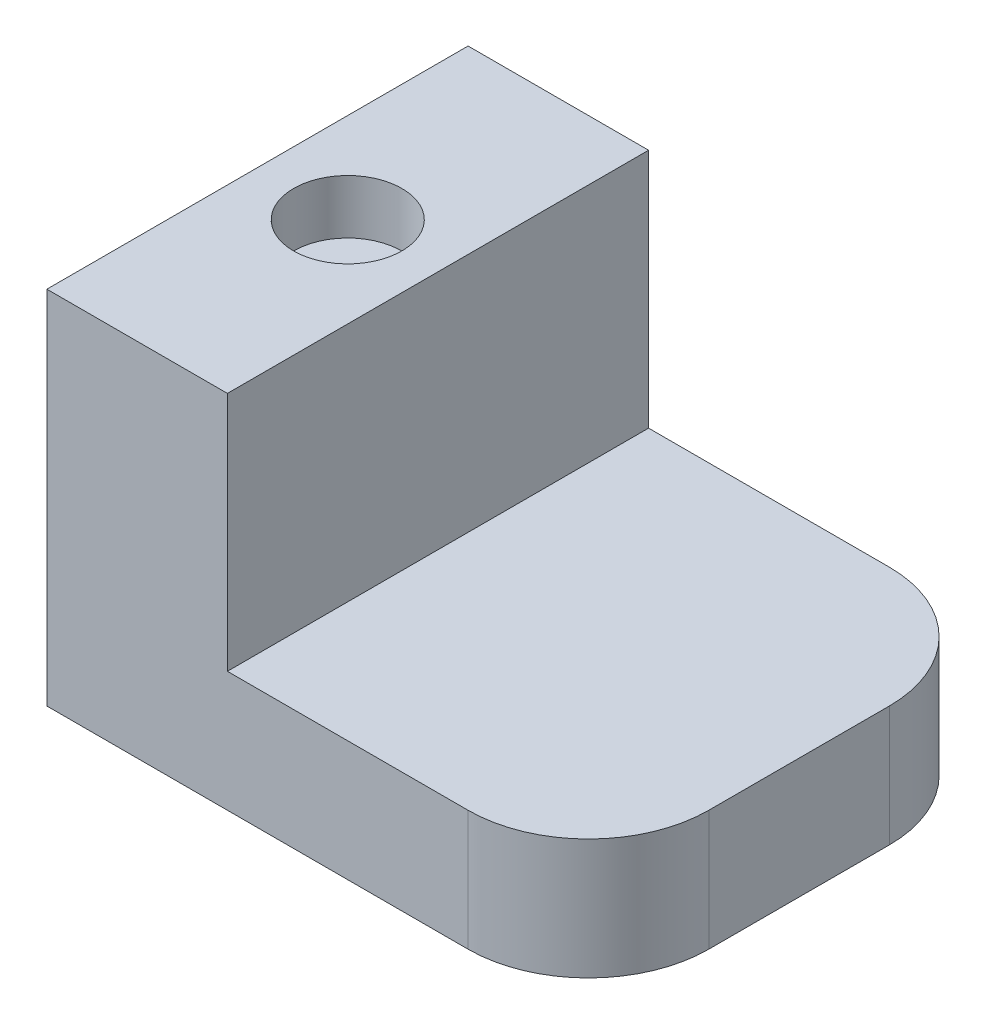
ISO-10303-21;
HEADER;
FILE_DESCRIPTION(('STEP AP214'),'2;1');
FILE_NAME('part.step','',(''),(''),'','','');
FILE_SCHEMA(('AUTOMOTIVE_DESIGN { 1 0 10303 214 1 1 1 1 }'));
ENDSEC;
DATA;
#1=APPLICATION_CONTEXT('core data for automotive mechanical design processes');
#2=APPLICATION_PROTOCOL_DEFINITION('international standard','automotive_design',2000,#1);
#3=PRODUCT_CONTEXT('',#1,'mechanical');
#4=PRODUCT('Part','Part','',(#3));
#5=PRODUCT_RELATED_PRODUCT_CATEGORY('part','',(#4));
#6=PRODUCT_DEFINITION_FORMATION('','',#4);
#7=PRODUCT_DEFINITION_CONTEXT('part definition',#1,'design');
#8=PRODUCT_DEFINITION('design','',#6,#7);
#9=PRODUCT_DEFINITION_SHAPE('','',#8);
#10=(LENGTH_UNIT() NAMED_UNIT(*) SI_UNIT(.MILLI.,.METRE.));
#11=(NAMED_UNIT(*) PLANE_ANGLE_UNIT() SI_UNIT($,.RADIAN.));
#12=(NAMED_UNIT(*) SI_UNIT($,.STERADIAN.) SOLID_ANGLE_UNIT());
#13=UNCERTAINTY_MEASURE_WITH_UNIT(LENGTH_MEASURE(1.E-05),#10,'distance_accuracy_value','');
#14=(GEOMETRIC_REPRESENTATION_CONTEXT(3) GLOBAL_UNCERTAINTY_ASSIGNED_CONTEXT((#13)) GLOBAL_UNIT_ASSIGNED_CONTEXT((#10,
#11,#12)) REPRESENTATION_CONTEXT('',''));
#15=CARTESIAN_POINT('',(0.,0.,0.));
#16=DIRECTION('',(0.,0.,1.));
#17=DIRECTION('',(1.,0.,0.));
#18=AXIS2_PLACEMENT_3D('',#15,#16,#17);
#19=CARTESIAN_POINT('',(0.,0.,70.));
#20=DIRECTION('',(1.,0.,0.));
#21=DIRECTION('',(0.,0.,-1.));
#22=AXIS2_PLACEMENT_3D('',#19,#20,#21);
#23=PLANE('',#22);
#24=DIRECTION('',(0.,-1.,0.));
#25=VECTOR('',#24,1.);
#26=CARTESIAN_POINT('',(0.,0.,0.));
#27=LINE('',#26,#25);
#28=CARTESIAN_POINT('',(0.,60.,0.));
#29=VERTEX_POINT('',#28);
#30=CARTESIAN_POINT('',(0.,0.,0.));
#31=VERTEX_POINT('',#30);
#32=EDGE_CURVE('E121',#29,#31,#27,.T.);
#33=ORIENTED_EDGE('',*,*,#32,.T.);
#34=DIRECTION('',(0.,0.,-1.));
#35=VECTOR('',#34,1.);
#36=CARTESIAN_POINT('',(0.,0.,70.));
#37=LINE('',#36,#35);
#38=CARTESIAN_POINT('',(0.,0.,70.));
#39=VERTEX_POINT('',#38);
#40=EDGE_CURVE('E136',#39,#31,#37,.T.);
#41=ORIENTED_EDGE('',*,*,#40,.F.);
#42=DIRECTION('',(0.,-1.,0.));
#43=VECTOR('',#42,1.);
#44=CARTESIAN_POINT('',(0.,0.,70.));
#45=LINE('',#44,#43);
#46=CARTESIAN_POINT('',(0.,60.,70.));
#47=VERTEX_POINT('',#46);
#48=EDGE_CURVE('E122',#47,#39,#45,.T.);
#49=ORIENTED_EDGE('',*,*,#48,.F.);
#50=DIRECTION('',(0.,0.,-1.));
#51=VECTOR('',#50,1.);
#52=CARTESIAN_POINT('',(0.,60.,70.));
#53=LINE('',#52,#51);
#54=EDGE_CURVE('E131',#47,#29,#53,.T.);
#55=ORIENTED_EDGE('',*,*,#54,.T.);
#56=EDGE_LOOP('',(#33,#41,#49,#55));
#57=FACE_BOUND('',#56,.T.);
#58=ADVANCED_FACE('F32',(#57),#23,.F.);
#59=CARTESIAN_POINT('',(0.,0.,70.));
#60=DIRECTION('',(0.,1.,0.));
#61=DIRECTION('',(0.,0.,1.));
#62=AXIS2_PLACEMENT_3D('',#59,#60,#61);
#63=PLANE('',#62);
#64=DIRECTION('',(1.,0.,0.));
#65=VECTOR('',#64,1.);
#66=CARTESIAN_POINT('',(0.,0.,0.));
#67=LINE('',#66,#65);
#68=CARTESIAN_POINT('',(70.,0.,0.));
#69=VERTEX_POINT('',#68);
#70=EDGE_CURVE('E123',#31,#69,#67,.T.);
#71=ORIENTED_EDGE('',*,*,#70,.T.);
#72=CARTESIAN_POINT('',(70.,0.,20.));
#73=DIRECTION('',(0.,1.,0.));
#74=DIRECTION('',(0.,0.,1.));
#75=AXIS2_PLACEMENT_3D('',#72,#73,#74);
#76=CIRCLE('',#75,20.);
#77=CARTESIAN_POINT('',(90.,0.,20.));
#78=VERTEX_POINT('',#77);
#79=EDGE_CURVE('E40',#69,#78,#76,.F.);
#80=ORIENTED_EDGE('',*,*,#79,.T.);
#81=DIRECTION('',(0.,0.,-1.));
#82=VECTOR('',#81,1.);
#83=CARTESIAN_POINT('',(90.,0.,70.));
#84=LINE('',#83,#82);
#85=CARTESIAN_POINT('',(90.,0.,50.));
#86=VERTEX_POINT('',#85);
#87=EDGE_CURVE('E133',#86,#78,#84,.T.);
#88=ORIENTED_EDGE('',*,*,#87,.F.);
#89=CARTESIAN_POINT('',(70.,0.,50.));
#90=DIRECTION('',(0.,1.,0.));
#91=DIRECTION('',(0.,0.,1.));
#92=AXIS2_PLACEMENT_3D('',#89,#90,#91);
#93=CIRCLE('',#92,20.);
#94=CARTESIAN_POINT('',(70.,0.,70.));
#95=VERTEX_POINT('',#94);
#96=EDGE_CURVE('E47',#86,#95,#93,.F.);
#97=ORIENTED_EDGE('',*,*,#96,.T.);
#98=DIRECTION('',(1.,0.,0.));
#99=VECTOR('',#98,1.);
#100=CARTESIAN_POINT('',(0.,0.,70.));
#101=LINE('',#100,#99);
#102=EDGE_CURVE('E126',#39,#95,#101,.T.);
#103=ORIENTED_EDGE('',*,*,#102,.F.);
#104=ORIENTED_EDGE('',*,*,#40,.T.);
#105=EDGE_LOOP('',(#71,#80,#88,#97,#103,#104));
#106=FACE_BOUND('',#105,.T.);
#107=ADVANCED_FACE('F150',(#106),#63,.F.);
#108=CARTESIAN_POINT('',(90.,0.,70.));
#109=DIRECTION('',(-1.,0.,0.));
#110=DIRECTION('',(0.,0.,1.));
#111=AXIS2_PLACEMENT_3D('',#108,#109,#110);
#112=PLANE('',#111);
#113=ORIENTED_EDGE('',*,*,#87,.T.);
#114=DIRECTION('',(0.,1.,0.));
#115=VECTOR('',#114,1.);
#116=CARTESIAN_POINT('',(90.,20.,20.));
#117=LINE('',#116,#115);
#118=CARTESIAN_POINT('',(90.,20.,20.));
#119=VERTEX_POINT('',#118);
#120=EDGE_CURVE('E141',#78,#119,#117,.T.);
#121=ORIENTED_EDGE('',*,*,#120,.T.);
#122=DIRECTION('',(0.,0.,1.));
#123=VECTOR('',#122,1.);
#124=CARTESIAN_POINT('',(90.,20.,0.));
#125=LINE('',#124,#123);
#126=CARTESIAN_POINT('',(90.,20.,50.));
#127=VERTEX_POINT('',#126);
#128=EDGE_CURVE('E161',#119,#127,#125,.T.);
#129=ORIENTED_EDGE('',*,*,#128,.T.);
#130=DIRECTION('',(0.,1.,0.));
#131=VECTOR('',#130,1.);
#132=CARTESIAN_POINT('',(90.,0.,50.));
#133=LINE('',#132,#131);
#134=EDGE_CURVE('E139',#127,#86,#133,.F.);
#135=ORIENTED_EDGE('',*,*,#134,.T.);
#136=EDGE_LOOP('',(#113,#121,#129,#135));
#137=FACE_BOUND('',#136,.T.);
#138=ADVANCED_FACE('F154',(#137),#112,.F.);
#139=CARTESIAN_POINT('',(0.,60.,70.));
#140=DIRECTION('',(0.,-1.,0.));
#141=DIRECTION('',(0.,0.,-1.));
#142=AXIS2_PLACEMENT_3D('',#139,#140,#141);
#143=PLANE('',#142);
#144=CARTESIAN_POINT('',(15.,60.,35.));
#145=DIRECTION('',(0.,1.,0.));
#146=DIRECTION('',(0.,0.,1.));
#147=AXIS2_PLACEMENT_3D('',#144,#145,#146);
#148=CIRCLE('',#147,9.);
#149=CARTESIAN_POINT('',(15.,60.,44.));
#150=VERTEX_POINT('',#149);
#151=EDGE_CURVE('E216',#150,#150,#148,.T.);
#152=ORIENTED_EDGE('',*,*,#151,.F.);
#153=EDGE_LOOP('',(#152));
#154=FACE_BOUND('',#153,.T.);
#155=DIRECTION('',(-1.,0.,0.));
#156=VECTOR('',#155,1.);
#157=CARTESIAN_POINT('',(0.,60.,70.));
#158=LINE('',#157,#156);
#159=CARTESIAN_POINT('',(30.,60.,70.));
#160=VERTEX_POINT('',#159);
#161=EDGE_CURVE('E116',#160,#47,#158,.T.);
#162=ORIENTED_EDGE('',*,*,#161,.F.);
#163=DIRECTION('',(0.,0.,1.));
#164=VECTOR('',#163,1.);
#165=CARTESIAN_POINT('',(30.,60.,0.));
#166=LINE('',#165,#164);
#167=CARTESIAN_POINT('',(30.,60.,0.));
#168=VERTEX_POINT('',#167);
#169=EDGE_CURVE('E103',#168,#160,#166,.T.);
#170=ORIENTED_EDGE('',*,*,#169,.F.);
#171=DIRECTION('',(-1.,0.,0.));
#172=VECTOR('',#171,1.);
#173=CARTESIAN_POINT('',(0.,60.,0.));
#174=LINE('',#173,#172);
#175=EDGE_CURVE('E114',#168,#29,#174,.T.);
#176=ORIENTED_EDGE('',*,*,#175,.T.);
#177=ORIENTED_EDGE('',*,*,#54,.F.);
#178=EDGE_LOOP('',(#162,#170,#176,#177));
#179=FACE_BOUND('',#178,.T.);
#180=ADVANCED_FACE('F112',(#154,#179),#143,.F.);
#181=CARTESIAN_POINT('',(0.,0.,70.));
#182=DIRECTION('',(0.,0.,-1.));
#183=DIRECTION('',(-1.,0.,0.));
#184=AXIS2_PLACEMENT_3D('',#181,#182,#183);
#185=PLANE('',#184);
#186=ORIENTED_EDGE('',*,*,#102,.T.);
#187=DIRECTION('',(0.,1.,0.));
#188=VECTOR('',#187,1.);
#189=CARTESIAN_POINT('',(70.,0.,70.));
#190=LINE('',#189,#188);
#191=CARTESIAN_POINT('',(70.,20.,70.));
#192=VERTEX_POINT('',#191);
#193=EDGE_CURVE('E11',#95,#192,#190,.T.);
#194=ORIENTED_EDGE('',*,*,#193,.T.);
#195=DIRECTION('',(1.,0.,0.));
#196=VECTOR('',#195,1.);
#197=CARTESIAN_POINT('',(90.,20.,70.));
#198=LINE('',#197,#196);
#199=CARTESIAN_POINT('',(30.,20.,70.));
#200=VERTEX_POINT('',#199);
#201=EDGE_CURVE('E108',#200,#192,#198,.T.);
#202=ORIENTED_EDGE('',*,*,#201,.F.);
#203=DIRECTION('',(0.,-1.,0.));
#204=VECTOR('',#203,1.);
#205=CARTESIAN_POINT('',(30.,60.,70.));
#206=LINE('',#205,#204);
#207=EDGE_CURVE('E165',#160,#200,#206,.T.);
#208=ORIENTED_EDGE('',*,*,#207,.F.);
#209=ORIENTED_EDGE('',*,*,#161,.T.);
#210=ORIENTED_EDGE('',*,*,#48,.T.);
#211=EDGE_LOOP('',(#186,#194,#202,#208,#209,#210));
#212=FACE_BOUND('',#211,.T.);
#213=ADVANCED_FACE('F177',(#212),#185,.F.);
#214=CARTESIAN_POINT('',(0.,0.,0.));
#215=DIRECTION('',(0.,0.,-1.));
#216=DIRECTION('',(-1.,0.,0.));
#217=AXIS2_PLACEMENT_3D('',#214,#215,#216);
#218=PLANE('',#217);
#219=DIRECTION('',(1.,0.,0.));
#220=VECTOR('',#219,1.);
#221=CARTESIAN_POINT('',(90.,20.,0.));
#222=LINE('',#221,#220);
#223=CARTESIAN_POINT('',(30.,20.,0.));
#224=VERTEX_POINT('',#223);
#225=CARTESIAN_POINT('',(70.,20.,0.));
#226=VERTEX_POINT('',#225);
#227=EDGE_CURVE('E107',#224,#226,#222,.T.);
#228=ORIENTED_EDGE('',*,*,#227,.T.);
#229=DIRECTION('',(0.,1.,0.));
#230=VECTOR('',#229,1.);
#231=CARTESIAN_POINT('',(70.,0.,0.));
#232=LINE('',#231,#230);
#233=EDGE_CURVE('E55',#226,#69,#232,.F.);
#234=ORIENTED_EDGE('',*,*,#233,.T.);
#235=ORIENTED_EDGE('',*,*,#70,.F.);
#236=ORIENTED_EDGE('',*,*,#32,.F.);
#237=ORIENTED_EDGE('',*,*,#175,.F.);
#238=DIRECTION('',(0.,-1.,0.));
#239=VECTOR('',#238,1.);
#240=CARTESIAN_POINT('',(30.,60.,0.));
#241=LINE('',#240,#239);
#242=EDGE_CURVE('E99',#168,#224,#241,.T.);
#243=ORIENTED_EDGE('',*,*,#242,.T.);
#244=EDGE_LOOP('',(#228,#234,#235,#236,#237,#243));
#245=FACE_BOUND('',#244,.T.);
#246=ADVANCED_FACE('F119',(#245),#218,.T.);
#247=CARTESIAN_POINT('',(90.,20.,0.));
#248=DIRECTION('',(0.,-1.,0.));
#249=DIRECTION('',(1.,0.,0.));
#250=AXIS2_PLACEMENT_3D('',#247,#248,#249);
#251=PLANE('',#250);
#252=ORIENTED_EDGE('',*,*,#128,.F.);
#253=CARTESIAN_POINT('',(70.,20.,20.));
#254=DIRECTION('',(0.,-1.,0.));
#255=DIRECTION('',(1.,0.,0.));
#256=AXIS2_PLACEMENT_3D('',#253,#254,#255);
#257=CIRCLE('',#256,20.);
#258=EDGE_CURVE('E146',#119,#226,#257,.F.);
#259=ORIENTED_EDGE('',*,*,#258,.T.);
#260=ORIENTED_EDGE('',*,*,#227,.F.);
#261=DIRECTION('',(0.,0.,1.));
#262=VECTOR('',#261,1.);
#263=CARTESIAN_POINT('',(30.,20.,0.));
#264=LINE('',#263,#262);
#265=EDGE_CURVE('E105',#224,#200,#264,.T.);
#266=ORIENTED_EDGE('',*,*,#265,.T.);
#267=ORIENTED_EDGE('',*,*,#201,.T.);
#268=CARTESIAN_POINT('',(70.,20.,50.));
#269=DIRECTION('',(0.,-1.,0.));
#270=DIRECTION('',(1.,0.,0.));
#271=AXIS2_PLACEMENT_3D('',#268,#269,#270);
#272=CIRCLE('',#271,20.);
#273=EDGE_CURVE('E144',#192,#127,#272,.F.);
#274=ORIENTED_EDGE('',*,*,#273,.T.);
#275=EDGE_LOOP('',(#252,#259,#260,#266,#267,#274));
#276=FACE_BOUND('',#275,.T.);
#277=ADVANCED_FACE('F160',(#276),#251,.F.);
#278=CARTESIAN_POINT('',(30.,60.,0.));
#279=DIRECTION('',(-1.,0.,0.));
#280=DIRECTION('',(0.,-1.,0.));
#281=AXIS2_PLACEMENT_3D('',#278,#279,#280);
#282=PLANE('',#281);
#283=ORIENTED_EDGE('',*,*,#207,.T.);
#284=ORIENTED_EDGE('',*,*,#265,.F.);
#285=ORIENTED_EDGE('',*,*,#242,.F.);
#286=ORIENTED_EDGE('',*,*,#169,.T.);
#287=EDGE_LOOP('',(#283,#284,#285,#286));
#288=FACE_BOUND('',#287,.T.);
#289=ADVANCED_FACE('F102',(#288),#282,.F.);
#290=CARTESIAN_POINT('',(15.,51.,35.));
#291=DIRECTION('',(0.,1.,0.));
#292=DIRECTION('',(0.,0.,1.));
#293=AXIS2_PLACEMENT_3D('',#290,#291,#292);
#294=CYLINDRICAL_SURFACE('',#293,9.);
#295=CARTESIAN_POINT('',(15.,51.,35.));
#296=DIRECTION('',(0.,1.,0.));
#297=DIRECTION('',(0.,0.,1.));
#298=AXIS2_PLACEMENT_3D('',#295,#296,#297);
#299=CIRCLE('',#298,9.);
#300=CARTESIAN_POINT('',(15.,51.,44.));
#301=VERTEX_POINT('',#300);
#302=EDGE_CURVE('E167',#301,#301,#299,.T.);
#303=ORIENTED_EDGE('',*,*,#302,.F.);
#304=EDGE_LOOP('',(#303));
#305=FACE_BOUND('',#304,.T.);
#306=ORIENTED_EDGE('',*,*,#151,.T.);
#307=EDGE_LOOP('',(#306));
#308=FACE_BOUND('',#307,.T.);
#309=ADVANCED_FACE('F204',(#305,#308),#294,.F.);
#310=CARTESIAN_POINT('',(15.,51.,35.));
#311=DIRECTION('',(0.,1.,0.));
#312=DIRECTION('',(0.,0.,1.));
#313=AXIS2_PLACEMENT_3D('',#310,#311,#312);
#314=PLANE('',#313);
#315=ORIENTED_EDGE('',*,*,#302,.T.);
#316=EDGE_LOOP('',(#315));
#317=FACE_BOUND('',#316,.T.);
#318=ADVANCED_FACE('F185',(#317),#314,.T.);
#319=CARTESIAN_POINT('',(70.,0.,20.));
#320=DIRECTION('',(0.,-1.,0.));
#321=DIRECTION('',(0.,0.,-1.));
#322=AXIS2_PLACEMENT_3D('',#319,#320,#321);
#323=CYLINDRICAL_SURFACE('',#322,20.);
#324=ORIENTED_EDGE('',*,*,#79,.F.);
#325=ORIENTED_EDGE('',*,*,#233,.F.);
#326=ORIENTED_EDGE('',*,*,#258,.F.);
#327=ORIENTED_EDGE('',*,*,#120,.F.);
#328=EDGE_LOOP('',(#324,#325,#326,#327));
#329=FACE_BOUND('',#328,.T.);
#330=ADVANCED_FACE('F158',(#329),#323,.T.);
#331=CARTESIAN_POINT('',(70.,0.,50.));
#332=DIRECTION('',(0.,1.,0.));
#333=DIRECTION('',(0.,0.,1.));
#334=AXIS2_PLACEMENT_3D('',#331,#332,#333);
#335=CYLINDRICAL_SURFACE('',#334,20.);
#336=ORIENTED_EDGE('',*,*,#96,.F.);
#337=ORIENTED_EDGE('',*,*,#134,.F.);
#338=ORIENTED_EDGE('',*,*,#273,.F.);
#339=ORIENTED_EDGE('',*,*,#193,.F.);
#340=EDGE_LOOP('',(#336,#337,#338,#339));
#341=FACE_BOUND('',#340,.T.);
#342=ADVANCED_FACE('F34',(#341),#335,.T.);
#343=CLOSED_SHELL('',(#58,#107,#138,#180,#213,#246,#277,#289,#309,#318,#330,#342));
#344=MANIFOLD_SOLID_BREP('B2',#343);
#345=ADVANCED_BREP_SHAPE_REPRESENTATION('',(#18,#344),#14);
#346=SHAPE_DEFINITION_REPRESENTATION(#9,#345);
ENDSEC;
END-ISO-10303-21;
